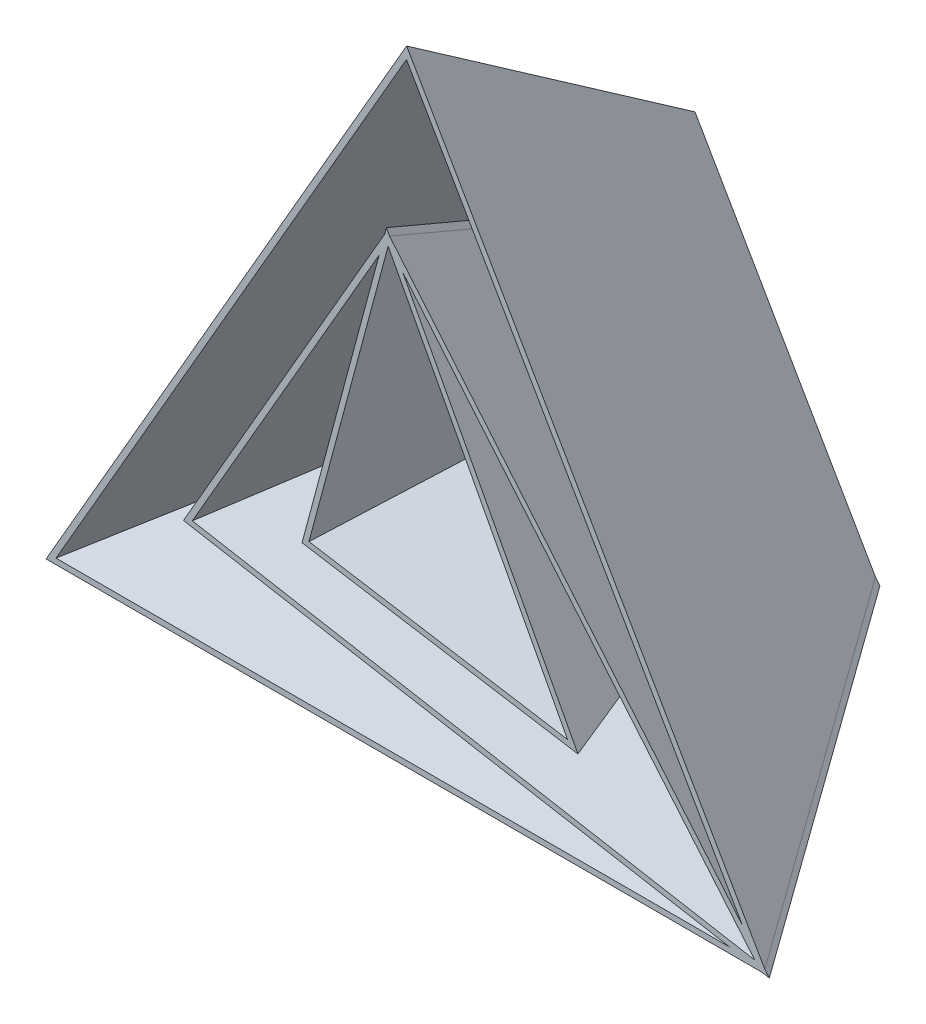
ISO-10303-21;
HEADER;
FILE_DESCRIPTION(('STEP AP214'),'2;1');
FILE_NAME('part.step','',(''),(''),'','','');
FILE_SCHEMA(('AUTOMOTIVE_DESIGN { 1 0 10303 214 1 1 1 1 }'));
ENDSEC;
DATA;
#1=APPLICATION_CONTEXT('core data for automotive mechanical design processes');
#2=APPLICATION_PROTOCOL_DEFINITION('international standard','automotive_design',2000,#1);
#3=PRODUCT_CONTEXT('',#1,'mechanical');
#4=PRODUCT('Part','Part','',(#3));
#5=PRODUCT_RELATED_PRODUCT_CATEGORY('part','',(#4));
#6=PRODUCT_DEFINITION_FORMATION('','',#4);
#7=PRODUCT_DEFINITION_CONTEXT('part definition',#1,'design');
#8=PRODUCT_DEFINITION('design','',#6,#7);
#9=PRODUCT_DEFINITION_SHAPE('','',#8);
#10=(LENGTH_UNIT() NAMED_UNIT(*) SI_UNIT(.MILLI.,.METRE.));
#11=(NAMED_UNIT(*) PLANE_ANGLE_UNIT() SI_UNIT($,.RADIAN.));
#12=(NAMED_UNIT(*) SI_UNIT($,.STERADIAN.) SOLID_ANGLE_UNIT());
#13=UNCERTAINTY_MEASURE_WITH_UNIT(LENGTH_MEASURE(1.E-05),#10,'distance_accuracy_value','');
#14=(GEOMETRIC_REPRESENTATION_CONTEXT(3) GLOBAL_UNCERTAINTY_ASSIGNED_CONTEXT((#13)) GLOBAL_UNIT_ASSIGNED_CONTEXT((#10,
#11,#12)) REPRESENTATION_CONTEXT('',''));
#15=CARTESIAN_POINT('',(0.,0.,0.));
#16=DIRECTION('',(0.,0.,1.));
#17=DIRECTION('',(1.,0.,0.));
#18=AXIS2_PLACEMENT_3D('',#15,#16,#17);
#19=CARTESIAN_POINT('',(7.50918770354472,-4.33543154203698,1.55165034379984));
#20=DIRECTION('',(-0.852483392799346,0.492181516312388,-0.176151695994541));
#21=DIRECTION('',(-0.5,-0.866025403784439,0.));
#22=AXIS2_PLACEMENT_3D('',#19,#20,#21);
#23=PLANE('',#22);
#24=DIRECTION('',(-0.0518053972687902,-0.414850654544686,-0.908413526560271));
#25=VECTOR('',#24,1.);
#26=CARTESIAN_POINT('',(40.2565005845038,43.8418837900998,-22.3173010963321));
#27=LINE('',#26,#25);
#28=CARTESIAN_POINT('',(41.529221229297,54.0336595582801,0.));
#29=VERTEX_POINT('',#28);
#30=CARTESIAN_POINT('',(39.2480840267302,35.7666196071897,-40.));
#31=VERTEX_POINT('',#30);
#32=EDGE_CURVE('E74',#29,#31,#27,.T.);
#33=ORIENTED_EDGE('',*,*,#32,.F.);
#34=DIRECTION('',(-0.5,-0.866025403784439,0.));
#35=VECTOR('',#34,1.);
#36=CARTESIAN_POINT('',(7.74965500351756,-4.47426540240759,0.));
#37=LINE('',#36,#35);
#38=CARTESIAN_POINT('',(17.8816974594018,13.0749469156289,0.));
#39=VERTEX_POINT('',#38);
#40=EDGE_CURVE('E272',#29,#39,#37,.T.);
#41=ORIENTED_EDGE('',*,*,#40,.T.);
#42=DIRECTION('',(0.249319096101502,0.0866248492887268,-0.964539332430169));
#43=VECTOR('',#42,1.);
#44=CARTESIAN_POINT('',(16.4877883121229,12.5906391682751,5.39260818528469));
#45=LINE('',#44,#43);
#46=CARTESIAN_POINT('',(28.2211035455524,16.6673291597195,-40.));
#47=VERTEX_POINT('',#46);
#48=EDGE_CURVE('E269',#39,#47,#45,.T.);
#49=ORIENTED_EDGE('',*,*,#48,.T.);
#50=DIRECTION('',(-0.5,-0.866025403784439,0.));
#51=VECTOR('',#50,1.);
#52=CARTESIAN_POINT('',(13.9486624263872,-8.05326400670986,-40.));
#53=LINE('',#52,#51);
#54=EDGE_CURVE('E70',#31,#47,#53,.T.);
#55=ORIENTED_EDGE('',*,*,#54,.F.);
#56=EDGE_LOOP('',(#33,#41,#49,#55));
#57=FACE_BOUND('',#56,.T.);
#58=ADVANCED_FACE('F55',(#57),#23,.F.);
#59=CARTESIAN_POINT('',(47.1671172501555,39.5779106883004,-20.7641485405259));
#60=DIRECTION('',(0.725880119364171,0.609085740437387,-0.319550642477364));
#61=DIRECTION('',(-0.642787609686534,0.766044443118983,0.));
#62=AXIS2_PLACEMENT_3D('',#59,#60,#61);
#63=PLANE('',#62);
#64=DIRECTION('',(0.0518053972687908,0.414850654544686,0.908413526560271));
#65=VECTOR('',#64,1.);
#66=CARTESIAN_POINT('',(43.2435767553376,43.4447390562514,-22.3062828928475));
#67=LINE('',#66,#65);
#68=CARTESIAN_POINT('',(42.2345318467171,35.3644431242602,-40.));
#69=VERTEX_POINT('',#68);
#70=CARTESIAN_POINT('',(44.5156690492841,53.6314830753507,0.));
#71=VERTEX_POINT('',#70);
#72=EDGE_CURVE('E249',#69,#71,#67,.T.);
#73=ORIENTED_EDGE('',*,*,#72,.F.);
#74=DIRECTION('',(-0.642787609686533,0.766044443118983,0.));
#75=VECTOR('',#74,1.);
#76=CARTESIAN_POINT('',(42.1978295531233,35.4081832145071,-40.));
#77=LINE('',#76,#75);
#78=CARTESIAN_POINT('',(63.0810009253125,10.5205887069397,-40.));
#79=VERTEX_POINT('',#78);
#80=EDGE_CURVE('E274',#79,#69,#77,.T.);
#81=ORIENTED_EDGE('',*,*,#80,.F.);
#82=DIRECTION('',(-0.533396460910442,0.205152484965555,-0.820609939862218));
#83=VECTOR('',#82,1.);
#84=CARTESIAN_POINT('',(63.7933731636514,10.2465993845017,-38.904042710248));
#85=LINE('',#84,#83);
#86=CARTESIAN_POINT('',(89.0810009253126,0.520588706939642,0.));
#87=VERTEX_POINT('',#86);
#88=EDGE_CURVE('E271',#87,#79,#85,.T.);
#89=ORIENTED_EDGE('',*,*,#88,.F.);
#90=DIRECTION('',(-0.642787609686534,0.766044443118983,0.));
#91=VECTOR('',#90,1.);
#92=CARTESIAN_POINT('',(52.5312170977326,44.0789248920004,0.));
#93=LINE('',#92,#91);
#94=EDGE_CURVE('E268',#87,#71,#93,.T.);
#95=ORIENTED_EDGE('',*,*,#94,.T.);
#96=EDGE_LOOP('',(#73,#81,#89,#95));
#97=FACE_BOUND('',#96,.T.);
#98=ADVANCED_FACE('F413',(#97),#63,.F.);
#99=CARTESIAN_POINT('',(6.91244932858518,-3.9909044806183,1.42834415660366));
#100=DIRECTION('',(-0.852483392799346,0.492181516312388,-0.176151695994541));
#101=DIRECTION('',(-0.5,-0.866025403784439,0.));
#102=AXIS2_PLACEMENT_3D('',#99,#100,#101);
#103=PLANE('',#102);
#104=DIRECTION('',(-0.5,-0.866025403784439,0.));
#105=VECTOR('',#104,1.);
#106=CARTESIAN_POINT('',(7.13380722931514,-4.118705524192,0.));
#107=LINE('',#106,#105);
#108=CARTESIAN_POINT('',(42.2403409857282,56.6875946195473,0.));
#109=VERTEX_POINT('',#108);
#110=CARTESIAN_POINT('',(16.760678195996,12.555524108009,0.));
#111=VERTEX_POINT('',#110);
#112=EDGE_CURVE('E290',#109,#111,#107,.T.);
#113=ORIENTED_EDGE('',*,*,#112,.F.);
#114=DIRECTION('',(-0.0518053972687902,-0.414850654544686,-0.908413526560271));
#115=VECTOR('',#114,1.);
#116=CARTESIAN_POINT('',(40.9086747850709,46.0237907669985,-23.3509181150331));
#117=LINE('',#116,#115);
#118=CARTESIAN_POINT('',(39.9592037831614,38.4205546684569,-40.));
#119=VERTEX_POINT('',#118);
#120=EDGE_CURVE('E12',#109,#119,#117,.T.);
#121=ORIENTED_EDGE('',*,*,#120,.T.);
#122=DIRECTION('',(-0.5,-0.866025403784439,0.));
#123=VECTOR('',#122,1.);
#124=CARTESIAN_POINT('',(13.3328146521848,-7.69770412849426,-40.));
#125=LINE('',#124,#123);
#126=CARTESIAN_POINT('',(27.1000842821466,16.1479063520995,-40.));
#127=VERTEX_POINT('',#126);
#128=EDGE_CURVE('E299',#119,#127,#125,.T.);
#129=ORIENTED_EDGE('',*,*,#128,.T.);
#130=DIRECTION('',(0.249319096101502,0.0866248492887268,-0.964539332430169));
#131=VECTOR('',#130,1.);
#132=CARTESIAN_POINT('',(15.4476697126136,12.099324948914,5.07962825888501));
#133=LINE('',#132,#131);
#134=EDGE_CURVE('E286',#111,#127,#133,.T.);
#135=ORIENTED_EDGE('',*,*,#134,.F.);
#136=EDGE_LOOP('',(#113,#121,#129,#135));
#137=FACE_BOUND('',#136,.T.);
#138=ADVANCED_FACE('F392',(#137),#103,.T.);
#139=CARTESIAN_POINT('',(47.6752333337104,40.0042707066066,-20.9878339902601));
#140=DIRECTION('',(0.725880119364171,0.609085740437387,-0.319550642477364));
#141=DIRECTION('',(-0.642787609686534,0.766044443118983,0.));
#142=AXIS2_PLACEMENT_3D('',#139,#140,#141);
#143=PLANE('',#142);
#144=DIRECTION('',(-0.642787609686533,0.766044443118983,0.));
#145=VECTOR('',#144,1.);
#146=CARTESIAN_POINT('',(42.7637313476831,35.8830312016047,-40.));
#147=LINE('',#146,#145);
#148=CARTESIAN_POINT('',(61.5220868883551,13.527693594849,-40.));
#149=VERTEX_POINT('',#148);
#150=CARTESIAN_POINT('',(40.5664495037521,38.5016497330516,-40.));
#151=VERTEX_POINT('',#150);
#152=EDGE_CURVE('E293',#149,#151,#147,.T.);
#153=ORIENTED_EDGE('',*,*,#152,.T.);
#154=DIRECTION('',(0.0518053972687908,0.414850654544686,0.908413526560271));
#155=VECTOR('',#154,1.);
#156=CARTESIAN_POINT('',(41.5125479252696,46.0778786613584,-23.4100566953551));
#157=LINE('',#156,#155);
#158=CARTESIAN_POINT('',(42.847586706319,56.768689684142,0.));
#159=VERTEX_POINT('',#158);
#160=EDGE_CURVE('E63',#151,#159,#157,.T.);
#161=ORIENTED_EDGE('',*,*,#160,.T.);
#162=DIRECTION('',(-0.642787609686534,0.766044443118983,0.));
#163=VECTOR('',#162,1.);
#164=CARTESIAN_POINT('',(53.0971188922924,44.5537728790981,0.));
#165=LINE('',#164,#163);
#166=CARTESIAN_POINT('',(87.5220868883551,3.52769359484903,0.));
#167=VERTEX_POINT('',#166);
#168=EDGE_CURVE('E278',#167,#159,#165,.T.);
#169=ORIENTED_EDGE('',*,*,#168,.F.);
#170=DIRECTION('',(-0.533396460910442,0.205152484965554,-0.820609939862218));
#171=VECTOR('',#170,1.);
#172=CARTESIAN_POINT('',(63.0070488404312,12.9565543825121,-37.7154431506522));
#173=LINE('',#172,#171);
#174=EDGE_CURVE('E347',#167,#149,#173,.T.);
#175=ORIENTED_EDGE('',*,*,#174,.T.);
#176=EDGE_LOOP('',(#153,#161,#169,#175));
#177=FACE_BOUND('',#176,.T.);
#178=ADVANCED_FACE('F367',(#177),#143,.T.);
#179=CARTESIAN_POINT('',(0.,0.,0.));
#180=DIRECTION('',(0.,0.,-1.));
#181=DIRECTION('',(-1.,0.,0.));
#182=AXIS2_PLACEMENT_3D('',#179,#180,#181);
#183=PLANE('',#182);
#184=ORIENTED_EDGE('',*,*,#168,.T.);
#185=DIRECTION('',(-0.469471562785884,0.88294759285893,0.));
#186=VECTOR('',#185,1.);
#187=CARTESIAN_POINT('',(56.9355149081058,30.2731502731421,0.));
#188=LINE('',#187,#186);
#189=CARTESIAN_POINT('',(42.458264858849,57.5008975862163,0.));
#190=VERTEX_POINT('',#189);
#191=EDGE_CURVE('E213',#159,#190,#188,.T.);
#192=ORIENTED_EDGE('',*,*,#191,.T.);
#193=DIRECTION('',(-0.258819045102522,-0.965925826289068,0.));
#194=VECTOR('',#193,1.);
#195=CARTESIAN_POINT('',(25.2388760170561,-6.76273644663943,0.));
#196=LINE('',#195,#194);
#197=EDGE_CURVE('E258',#190,#109,#196,.T.);
#198=ORIENTED_EDGE('',*,*,#197,.T.);
#199=ORIENTED_EDGE('',*,*,#112,.T.);
#200=DIRECTION('',(0.984807753012209,-0.173648177666924,0.));
#201=VECTOR('',#200,1.);
#202=CARTESIAN_POINT('',(2.65251736540058,15.0431735106172,0.));
#203=LINE('',#202,#201);
#204=CARTESIAN_POINT('',(85.9205555827156,0.36077174224154,0.));
#205=VERTEX_POINT('',#204);
#206=EDGE_CURVE('E303',#111,#205,#203,.T.);
#207=ORIENTED_EDGE('',*,*,#206,.T.);
#208=DIRECTION('',(-1.,0.,0.));
#209=VECTOR('',#208,1.);
#210=CARTESIAN_POINT('',(0.,0.360771742241547,0.));
#211=LINE('',#210,#209);
#212=CARTESIAN_POINT('',(0.628680999628947,0.360771742241547,0.));
#213=VERTEX_POINT('',#212);
#214=EDGE_CURVE('E333',#205,#213,#211,.T.);
#215=ORIENTED_EDGE('',*,*,#214,.T.);
#216=DIRECTION('',(0.5,0.866025403784439,0.));
#217=VECTOR('',#216,1.);
#218=CARTESIAN_POINT('',(0.315292002847334,-0.182033922717245,0.));
#219=LINE('',#218,#217);
#220=CARTESIAN_POINT('',(44.9895955360447,77.1961295895344,0.));
#221=VERTEX_POINT('',#220);
#222=EDGE_CURVE('E321',#213,#221,#219,.T.);
#223=ORIENTED_EDGE('',*,*,#222,.T.);
#224=DIRECTION('',(0.5,-0.866025403784439,0.));
#225=VECTOR('',#224,1.);
#226=CARTESIAN_POINT('',(67.1691013012198,38.7800987174845,0.));
#227=LINE('',#226,#225);
#228=EDGE_CURVE('E316',#221,#167,#227,.T.);
#229=ORIENTED_EDGE('',*,*,#228,.T.);
#230=EDGE_LOOP('',(#184,#192,#198,#199,#207,#215,#223,#229));
#231=FACE_BOUND('',#230,.T.);
#232=CARTESIAN_POINT('',(66.6913720437682,11.9250515659638,0.));
#233=VERTEX_POINT('',#232);
#234=EDGE_CURVE('E259',#233,#71,#188,.T.);
#235=ORIENTED_EDGE('',*,*,#234,.T.);
#236=ORIENTED_EDGE('',*,*,#94,.F.);
#237=DIRECTION('',(0.984807753012209,-0.173648177666924,0.));
#238=VECTOR('',#237,1.);
#239=CARTESIAN_POINT('',(2.77514676386724,15.7386393886918,0.));
#240=LINE('',#239,#238);
#241=EDGE_CURVE('E282',#39,#87,#240,.T.);
#242=ORIENTED_EDGE('',*,*,#241,.F.);
#243=ORIENTED_EDGE('',*,*,#40,.F.);
#244=CARTESIAN_POINT('',(31.7705211765705,17.6136951456797,0.));
#245=VERTEX_POINT('',#244);
#246=EDGE_CURVE('E262',#29,#245,#196,.T.);
#247=ORIENTED_EDGE('',*,*,#246,.T.);
#248=DIRECTION('',(0.986989989981482,-0.160781714371859,0.));
#249=VECTOR('',#248,1.);
#250=CARTESIAN_POINT('',(3.61640838037537,22.2000299291519,0.));
#251=LINE('',#250,#249);
#252=EDGE_CURVE('E240',#245,#233,#251,.T.);
#253=ORIENTED_EDGE('',*,*,#252,.T.);
#254=EDGE_LOOP('',(#235,#236,#242,#243,#247,#253));
#255=FACE_BOUND('',#254,.T.);
#256=DIRECTION('',(-0.469471562785884,0.88294759285893,0.));
#257=VECTOR('',#256,1.);
#258=CARTESIAN_POINT('',(56.2961576686903,29.9331979987438,0.));
#259=LINE('',#258,#257);
#260=CARTESIAN_POINT('',(65.3803330450879,12.848348952505,0.));
#261=VERTEX_POINT('',#260);
#262=CARTESIAN_POINT('',(42.6662839514185,55.5672622181456,0.));
#263=VERTEX_POINT('',#262);
#264=EDGE_CURVE('E232',#261,#263,#259,.T.);
#265=ORIENTED_EDGE('',*,*,#264,.F.);
#266=DIRECTION('',(0.986989989981482,-0.160781714371859,0.));
#267=VECTOR('',#266,1.);
#268=CARTESIAN_POINT('',(3.72903503561982,22.8914106733221,0.));
#269=LINE('',#268,#267);
#270=CARTESIAN_POINT('',(32.6485040254953,18.1803985555566,0.));
#271=VERTEX_POINT('',#270);
#272=EDGE_CURVE('E222',#271,#261,#269,.T.);
#273=ORIENTED_EDGE('',*,*,#272,.F.);
#274=DIRECTION('',(-0.258819045102522,-0.965925826289068,0.));
#275=VECTOR('',#274,1.);
#276=CARTESIAN_POINT('',(25.9163693146772,-6.94427022861451,0.));
#277=LINE('',#276,#275);
#278=EDGE_CURVE('E221',#263,#271,#277,.T.);
#279=ORIENTED_EDGE('',*,*,#278,.F.);
#280=EDGE_LOOP('',(#265,#273,#279));
#281=FACE_BOUND('',#280,.T.);
#282=DIRECTION('',(-1.,0.,0.));
#283=VECTOR('',#282,1.);
#284=CARTESIAN_POINT('',(0.,-0.360771742241544,0.));
#285=LINE('',#284,#283);
#286=CARTESIAN_POINT('',(90.0126320283283,-0.360771742241548,0.));
#287=VERTEX_POINT('',#286);
#288=CARTESIAN_POINT('',(-0.628680999628982,-0.360771742241543,0.));
#289=VERTEX_POINT('',#288);
#290=EDGE_CURVE('E354',#287,#289,#285,.T.);
#291=ORIENTED_EDGE('',*,*,#290,.F.);
#292=CARTESIAN_POINT('',(90.9189990746875,-0.520588706939697,0.));
#293=VERTEX_POINT('',#292);
#294=EDGE_CURVE('E306',#287,#293,#203,.T.);
#295=ORIENTED_EDGE('',*,*,#294,.T.);
#296=CARTESIAN_POINT('',(90.3508181498955,0.156542951424623,0.));
#297=VERTEX_POINT('',#296);
#298=EDGE_CURVE('E307',#293,#297,#165,.T.);
#299=ORIENTED_EDGE('',*,*,#298,.T.);
#300=DIRECTION('',(0.5,-0.866025403784439,0.));
#301=VECTOR('',#300,1.);
#302=CARTESIAN_POINT('',(67.8308986987802,39.162187623115,0.));
#303=LINE('',#302,#301);
#304=CARTESIAN_POINT('',(45.0104044639552,78.6884430916645,0.));
#305=VERTEX_POINT('',#304);
#306=EDGE_CURVE('E327',#305,#297,#303,.T.);
#307=ORIENTED_EDGE('',*,*,#306,.F.);
#308=DIRECTION('',(0.5,0.866025403784439,0.));
#309=VECTOR('',#308,1.);
#310=CARTESIAN_POINT('',(-0.315292002847363,0.182033922717261,0.));
#311=LINE('',#310,#309);
#312=EDGE_CURVE('E341',#289,#305,#311,.T.);
#313=ORIENTED_EDGE('',*,*,#312,.F.);
#314=EDGE_LOOP('',(#291,#295,#299,#307,#313));
#315=FACE_BOUND('',#314,.T.);
#316=ADVANCED_FACE('F372',(#231,#255,#281,#315),#183,.F.);
#317=CARTESIAN_POINT('',(0.,0.,-40.));
#318=DIRECTION('',(0.,0.,-1.));
#319=DIRECTION('',(-1.,0.,0.));
#320=AXIS2_PLACEMENT_3D('',#317,#318,#319);
#321=PLANE('',#320);
#322=DIRECTION('',(0.469471562785884,-0.882947592858931,0.));
#323=VECTOR('',#322,1.);
#324=CARTESIAN_POINT('',(47.5851172096542,25.3014556270897,-40.));
#325=LINE('',#324,#323);
#326=CARTESIAN_POINT('',(40.1771276562821,39.2338576351258,-40.));
#327=VERTEX_POINT('',#326);
#328=EDGE_CURVE('E250',#327,#151,#325,.T.);
#329=ORIENTED_EDGE('',*,*,#328,.T.);
#330=ORIENTED_EDGE('',*,*,#152,.F.);
#331=DIRECTION('',(0.5,-0.866025403784439,0.));
#332=VECTOR('',#331,1.);
#333=CARTESIAN_POINT('',(51.999228320142,30.0217684682868,-40.));
#334=LINE('',#333,#332);
#335=CARTESIAN_POINT('',(41.4895955360447,48.2249864192347,-40.));
#336=VERTEX_POINT('',#335);
#337=EDGE_CURVE('E324',#336,#149,#334,.T.);
#338=ORIENTED_EDGE('',*,*,#337,.F.);
#339=DIRECTION('',(0.5,0.866025403784439,0.));
#340=VECTOR('',#339,1.);
#341=CARTESIAN_POINT('',(10.2351649839251,-5.90927525866942,-40.));
#342=LINE('',#341,#340);
#343=CARTESIAN_POINT('',(19.628680999629,10.3607717422415,-40.));
#344=VERTEX_POINT('',#343);
#345=EDGE_CURVE('E325',#344,#336,#342,.T.);
#346=ORIENTED_EDGE('',*,*,#345,.F.);
#347=DIRECTION('',(-1.,0.,0.));
#348=VECTOR('',#347,1.);
#349=CARTESIAN_POINT('',(0.,10.3607717422415,-40.));
#350=LINE('',#349,#348);
#351=CARTESIAN_POINT('',(59.9205555827157,10.3607717422416,-40.));
#352=VERTEX_POINT('',#351);
#353=EDGE_CURVE('E328',#352,#344,#350,.T.);
#354=ORIENTED_EDGE('',*,*,#353,.F.);
#355=DIRECTION('',(0.984807753012209,-0.173648177666923,0.));
#356=VECTOR('',#355,1.);
#357=CARTESIAN_POINT('',(3.57862215224568,20.2953747513133,-40.));
#358=LINE('',#357,#356);
#359=EDGE_CURVE('E294',#127,#352,#358,.T.);
#360=ORIENTED_EDGE('',*,*,#359,.F.);
#361=ORIENTED_EDGE('',*,*,#128,.F.);
#362=DIRECTION('',(0.258819045102521,0.965925826289068,0.));
#363=VECTOR('',#362,1.);
#364=CARTESIAN_POINT('',(27.677306020075,-7.41611179674802,-40.0000000000001));
#365=LINE('',#364,#363);
#366=EDGE_CURVE('E246',#119,#327,#365,.T.);
#367=ORIENTED_EDGE('',*,*,#366,.T.);
#368=EDGE_LOOP('',(#329,#330,#338,#346,#354,#360,#361,#367));
#369=FACE_BOUND('',#368,.T.);
#370=CARTESIAN_POINT('',(34.6657648760541,18.6651717203706,-40.0000000000001));
#371=VERTEX_POINT('',#370);
#372=EDGE_CURVE('E251',#371,#31,#365,.T.);
#373=ORIENTED_EDGE('',*,*,#372,.T.);
#374=ORIENTED_EDGE('',*,*,#54,.T.);
#375=DIRECTION('',(0.984807753012209,-0.173648177666923,0.));
#376=VECTOR('',#375,1.);
#377=CARTESIAN_POINT('',(3.70125155071233,20.9908406293879,-40.));
#378=LINE('',#377,#376);
#379=EDGE_CURVE('E275',#47,#79,#378,.T.);
#380=ORIENTED_EDGE('',*,*,#379,.T.);
#381=ORIENTED_EDGE('',*,*,#80,.T.);
#382=CARTESIAN_POINT('',(52.6734457715542,15.7317014363466,-40.));
#383=VERTEX_POINT('',#382);
#384=EDGE_CURVE('E254',#69,#383,#325,.T.);
#385=ORIENTED_EDGE('',*,*,#384,.T.);
#386=DIRECTION('',(-0.986989989981482,0.160781714371859,0.));
#387=VECTOR('',#386,1.);
#388=CARTESIAN_POINT('',(3.85811138679822,23.6837710922545,-40.0000000000001));
#389=LINE('',#388,#387);
#390=EDGE_CURVE('E247',#383,#371,#389,.T.);
#391=ORIENTED_EDGE('',*,*,#390,.T.);
#392=EDGE_LOOP('',(#373,#374,#380,#381,#385,#391));
#393=FACE_BOUND('',#392,.T.);
#394=DIRECTION('',(0.258819045102521,0.965925826289068,0.));
#395=VECTOR('',#394,1.);
#396=CARTESIAN_POINT('',(28.3547993176961,-7.59764557872311,-40.0000000000001));
#397=LINE('',#396,#395);
#398=CARTESIAN_POINT('',(35.5437477249789,19.2318751302475,-40.0000000000001));
#399=VERTEX_POINT('',#398);
#400=CARTESIAN_POINT('',(40.3851467488517,37.3002222670551,-40.));
#401=VERTEX_POINT('',#400);
#402=EDGE_CURVE('E219',#399,#401,#397,.T.);
#403=ORIENTED_EDGE('',*,*,#402,.F.);
#404=DIRECTION('',(-0.986989989981482,0.160781714371859,0.));
#405=VECTOR('',#404,1.);
#406=CARTESIAN_POINT('',(3.97073804204267,24.3751518364247,-40.0000000000001));
#407=LINE('',#406,#405);
#408=CARTESIAN_POINT('',(51.3624067728739,16.6549988228878,-40.));
#409=VERTEX_POINT('',#408);
#410=EDGE_CURVE('E203',#409,#399,#407,.T.);
#411=ORIENTED_EDGE('',*,*,#410,.F.);
#412=DIRECTION('',(0.469471562785884,-0.882947592858931,0.));
#413=VECTOR('',#412,1.);
#414=CARTESIAN_POINT('',(46.9457599702386,24.9615033526914,-40.));
#415=LINE('',#414,#413);
#416=EDGE_CURVE('E214',#401,#409,#415,.T.);
#417=ORIENTED_EDGE('',*,*,#416,.F.);
#418=EDGE_LOOP('',(#403,#411,#417));
#419=FACE_BOUND('',#418,.T.);
#420=CARTESIAN_POINT('',(64.0126320283284,9.63922825775846,-40.0000000000001));
#421=VERTEX_POINT('',#420);
#422=CARTESIAN_POINT('',(64.9189990746874,9.47941129306034,-40.0000000000001));
#423=VERTEX_POINT('',#422);
#424=EDGE_CURVE('E298',#421,#423,#358,.T.);
#425=ORIENTED_EDGE('',*,*,#424,.F.);
#426=DIRECTION('',(-1.,0.,0.));
#427=VECTOR('',#426,1.);
#428=CARTESIAN_POINT('',(0.,9.63922825775845,-40.));
#429=LINE('',#428,#427);
#430=CARTESIAN_POINT('',(18.371319000371,9.63922825775846,-40.));
#431=VERTEX_POINT('',#430);
#432=EDGE_CURVE('E348',#421,#431,#429,.T.);
#433=ORIENTED_EDGE('',*,*,#432,.T.);
#434=DIRECTION('',(0.5,0.866025403784439,0.));
#435=VECTOR('',#434,1.);
#436=CARTESIAN_POINT('',(9.60458097823045,-5.54520741323492,-40.));
#437=LINE('',#436,#435);
#438=CARTESIAN_POINT('',(41.5104044639552,49.7172999213647,-40.));
#439=VERTEX_POINT('',#438);
#440=EDGE_CURVE('E345',#431,#439,#437,.T.);
#441=ORIENTED_EDGE('',*,*,#440,.T.);
#442=DIRECTION('',(0.5,-0.866025403784439,0.));
#443=VECTOR('',#442,1.);
#444=CARTESIAN_POINT('',(52.6610257177024,30.4038573739173,-40.));
#445=LINE('',#444,#443);
#446=CARTESIAN_POINT('',(64.3508181498955,10.1565429514246,-40.));
#447=VERTEX_POINT('',#446);
#448=EDGE_CURVE('E344',#439,#447,#445,.T.);
#449=ORIENTED_EDGE('',*,*,#448,.T.);
#450=EDGE_CURVE('E301',#423,#447,#147,.T.);
#451=ORIENTED_EDGE('',*,*,#450,.F.);
#452=EDGE_LOOP('',(#425,#433,#441,#449,#451));
#453=FACE_BOUND('',#452,.T.);
#454=ADVANCED_FACE('F224',(#369,#393,#419,#453),#321,.T.);
#455=CARTESIAN_POINT('',(-0.291396544061684,0.16823787315494,-0.0963538901405651));
#456=DIRECTION('',(0.832561554461918,-0.480679637585522,0.275296828973031));
#457=DIRECTION('',(0.5,0.866025403784439,0.));
#458=AXIS2_PLACEMENT_3D('',#455,#456,#457);
#459=PLANE('',#458);
#460=DIRECTION('',(-0.0706879298359585,-0.585117181625618,-0.807862055268101));
#461=VECTOR('',#460,1.);
#462=CARTESIAN_POINT('',(41.5308863795956,49.8868383529128,-39.7659209641105));
#463=LINE('',#462,#461);
#464=EDGE_CURVE('E337',#305,#439,#463,.T.);
#465=ORIENTED_EDGE('',*,*,#464,.T.);
#466=ORIENTED_EDGE('',*,*,#440,.F.);
#467=DIRECTION('',(0.41851844695489,0.220272866818363,-0.881091467273453));
#468=VECTOR('',#467,1.);
#469=CARTESIAN_POINT('',(-0.48530376921076,-0.285310042021426,-0.301846800880468));
#470=LINE('',#469,#468);
#471=EDGE_CURVE('E340',#289,#431,#470,.T.);
#472=ORIENTED_EDGE('',*,*,#471,.F.);
#473=ORIENTED_EDGE('',*,*,#312,.T.);
#474=EDGE_LOOP('',(#465,#466,#472,#473));
#475=FACE_BOUND('',#474,.T.);
#476=ADVANCED_FACE('F449',(#475),#459,.F.);
#477=CARTESIAN_POINT('',(0.,-0.339549875050864,-0.0848874687627161));
#478=DIRECTION('',(0.,0.970142500145332,0.242535625036333));
#479=DIRECTION('',(0.,-0.242535625036333,0.970142500145332));
#480=AXIS2_PLACEMENT_3D('',#477,#478,#479);
#481=PLANE('',#480);
#482=ORIENTED_EDGE('',*,*,#432,.F.);
#483=DIRECTION('',(0.533396460910441,-0.205152484965555,0.820609939862219));
#484=VECTOR('',#483,1.);
#485=CARTESIAN_POINT('',(64.3634990720436,9.50427939479107,-39.4602045481305));
#486=LINE('',#485,#484);
#487=EDGE_CURVE('E313',#421,#287,#486,.T.);
#488=ORIENTED_EDGE('',*,*,#487,.T.);
#489=ORIENTED_EDGE('',*,*,#290,.T.);
#490=ORIENTED_EDGE('',*,*,#471,.T.);
#491=EDGE_LOOP('',(#482,#488,#489,#490));
#492=FACE_BOUND('',#491,.T.);
#493=ADVANCED_FACE('F409',(#492),#481,.F.);
#494=CARTESIAN_POINT('',(56.916056852012,32.8605007447212,-28.7803117676275));
#495=DIRECTION('',(-0.793294144001325,-0.458008587585719,0.401139046704431));
#496=DIRECTION('',(0.5,-0.866025403784439,0.));
#497=AXIS2_PLACEMENT_3D('',#494,#495,#496);
#498=PLANE('',#497);
#499=ORIENTED_EDGE('',*,*,#306,.T.);
#500=DIRECTION('',(-0.533396460910442,0.205152484965554,-0.820609939862218));
#501=VECTOR('',#500,1.);
#502=CARTESIAN_POINT('',(64.6620757669162,10.0368284833398,-39.5211421276606));
#503=LINE('',#502,#501);
#504=EDGE_CURVE('E297',#297,#447,#503,.T.);
#505=ORIENTED_EDGE('',*,*,#504,.T.);
#506=ORIENTED_EDGE('',*,*,#448,.F.);
#507=ORIENTED_EDGE('',*,*,#464,.F.);
#508=EDGE_LOOP('',(#499,#505,#506,#507));
#509=FACE_BOUND('',#508,.T.);
#510=ADVANCED_FACE('F57',(#509),#498,.F.);
#511=CARTESIAN_POINT('',(0.291396544061658,-0.168237873154925,0.0963538901405565));
#512=DIRECTION('',(0.832561554461918,-0.480679637585522,0.275296828973031));
#513=DIRECTION('',(0.5,0.866025403784439,0.));
#514=AXIS2_PLACEMENT_3D('',#511,#512,#513);
#515=PLANE('',#514);
#516=DIRECTION('',(-0.0706879298359585,-0.585117181625618,-0.807862055268101));
#517=VECTOR('',#516,1.);
#518=CARTESIAN_POINT('',(41.5719045937083,48.9062971317441,-39.0593250552739));
#519=LINE('',#518,#517);
#520=EDGE_CURVE('E317',#221,#336,#519,.T.);
#521=ORIENTED_EDGE('',*,*,#520,.F.);
#522=ORIENTED_EDGE('',*,*,#222,.F.);
#523=DIRECTION('',(0.41851844695489,0.220272866818363,-0.881091467273453));
#524=VECTOR('',#523,1.);
#525=CARTESIAN_POINT('',(0.48530376921073,0.285310042021433,0.301846800880455));
#526=LINE('',#525,#524);
#527=EDGE_CURVE('E320',#213,#344,#526,.T.);
#528=ORIENTED_EDGE('',*,*,#527,.T.);
#529=ORIENTED_EDGE('',*,*,#345,.T.);
#530=EDGE_LOOP('',(#521,#522,#528,#529));
#531=FACE_BOUND('',#530,.T.);
#532=ADVANCED_FACE('F401',(#531),#515,.T.);
#533=CARTESIAN_POINT('',(0.,0.339549875050868,0.084887468762717));
#534=DIRECTION('',(0.,0.970142500145332,0.242535625036333));
#535=DIRECTION('',(0.,-0.242535625036333,0.970142500145332));
#536=AXIS2_PLACEMENT_3D('',#533,#534,#535);
#537=PLANE('',#536);
#538=DIRECTION('',(0.533396460910441,-0.205152484965555,0.820609939862219));
#539=VECTOR('',#538,1.);
#540=CARTESIAN_POINT('',(61.5146233769359,9.74766874446456,-37.5475880088921));
#541=LINE('',#540,#539);
#542=EDGE_CURVE('E360',#352,#205,#541,.T.);
#543=ORIENTED_EDGE('',*,*,#542,.F.);
#544=ORIENTED_EDGE('',*,*,#353,.T.);
#545=ORIENTED_EDGE('',*,*,#527,.F.);
#546=ORIENTED_EDGE('',*,*,#214,.F.);
#547=EDGE_LOOP('',(#543,#544,#545,#546));
#548=FACE_BOUND('',#547,.T.);
#549=ADVANCED_FACE('F398',(#548),#537,.T.);
#550=CARTESIAN_POINT('',(56.3607509512111,32.5398947334112,-28.4995144349344));
#551=DIRECTION('',(-0.793294144001325,-0.458008587585719,0.401139046704431));
#552=DIRECTION('',(0.5,-0.866025403784439,0.));
#553=AXIS2_PLACEMENT_3D('',#550,#551,#552);
#554=PLANE('',#553);
#555=ORIENTED_EDGE('',*,*,#174,.F.);
#556=ORIENTED_EDGE('',*,*,#228,.F.);
#557=ORIENTED_EDGE('',*,*,#520,.T.);
#558=ORIENTED_EDGE('',*,*,#337,.T.);
#559=EDGE_LOOP('',(#555,#556,#557,#558));
#560=FACE_BOUND('',#559,.T.);
#561=ADVANCED_FACE('F378',(#560),#554,.T.);
#562=CARTESIAN_POINT('',(2.72667452102678,15.4637396391146,2.09359647111125));
#563=DIRECTION('',(-0.172124979726378,-0.976169268224314,-0.132161080233933));
#564=DIRECTION('',(0.984807753012209,-0.173648177666924,0.));
#565=AXIS2_PLACEMENT_3D('',#562,#563,#564);
#566=PLANE('',#565);
#567=ORIENTED_EDGE('',*,*,#48,.F.);
#568=ORIENTED_EDGE('',*,*,#241,.T.);
#569=ORIENTED_EDGE('',*,*,#88,.T.);
#570=ORIENTED_EDGE('',*,*,#379,.F.);
#571=EDGE_LOOP('',(#567,#568,#569,#570));
#572=FACE_BOUND('',#571,.T.);
#573=ADVANCED_FACE('F425',(#572),#566,.F.);
#574=CARTESIAN_POINT('',(2.60618703521831,14.7804211513576,2.0010837149475));
#575=DIRECTION('',(-0.172124979726378,-0.976169268224314,-0.132161080233933));
#576=DIRECTION('',(0.984807753012209,-0.173648177666924,0.));
#577=AXIS2_PLACEMENT_3D('',#574,#575,#576);
#578=PLANE('',#577);
#579=ORIENTED_EDGE('',*,*,#359,.T.);
#580=ORIENTED_EDGE('',*,*,#542,.T.);
#581=ORIENTED_EDGE('',*,*,#206,.F.);
#582=ORIENTED_EDGE('',*,*,#134,.T.);
#583=EDGE_LOOP('',(#579,#580,#581,#582));
#584=FACE_BOUND('',#583,.T.);
#585=ADVANCED_FACE('F395',(#584),#578,.T.);
#586=ORIENTED_EDGE('',*,*,#487,.F.);
#587=ORIENTED_EDGE('',*,*,#424,.T.);
#588=DIRECTION('',(-0.533396460910442,0.205152484965555,-0.820609939862218));
#589=VECTOR('',#588,1.);
#590=CARTESIAN_POINT('',(64.9945056242274,9.45037031246803,-39.8838360776308));
#591=LINE('',#590,#589);
#592=EDGE_CURVE('E289',#293,#423,#591,.T.);
#593=ORIENTED_EDGE('',*,*,#592,.F.);
#594=ORIENTED_EDGE('',*,*,#294,.F.);
#595=EDGE_LOOP('',(#586,#587,#593,#594));
#596=FACE_BOUND('',#595,.T.);
#597=ADVANCED_FACE('F424',(#596),#578,.T.);
#598=ORIENTED_EDGE('',*,*,#504,.F.);
#599=ORIENTED_EDGE('',*,*,#298,.F.);
#600=ORIENTED_EDGE('',*,*,#592,.T.);
#601=ORIENTED_EDGE('',*,*,#450,.T.);
#602=EDGE_LOOP('',(#598,#599,#600,#601));
#603=FACE_BOUND('',#602,.T.);
#604=ADVANCED_FACE('F427',(#603),#143,.T.);
#605=CARTESIAN_POINT('',(53.2061717941452,28.2902233655474,-15.953730458238));
#606=DIRECTION('',(-0.853540841601486,-0.453835715787779,0.255931972980362));
#607=DIRECTION('',(0.469471562785884,-0.88294759285893,0.));
#608=AXIS2_PLACEMENT_3D('',#605,#606,#607);
#609=PLANE('',#608);
#610=ORIENTED_EDGE('',*,*,#160,.F.);
#611=ORIENTED_EDGE('',*,*,#328,.F.);
#612=DIRECTION('',(-0.0518053972687904,-0.414850654544687,-0.908413526560271));
#613=VECTOR('',#612,1.);
#614=CARTESIAN_POINT('',(41.108534691158,46.692439914902,-23.6676718291605));
#615=LINE('',#614,#613);
#616=EDGE_CURVE('E243',#190,#327,#615,.T.);
#617=ORIENTED_EDGE('',*,*,#616,.F.);
#618=ORIENTED_EDGE('',*,*,#191,.F.);
#619=EDGE_LOOP('',(#610,#611,#617,#618));
#620=FACE_BOUND('',#619,.T.);
#621=ADVANCED_FACE('F385',(#620),#609,.F.);
#622=CARTESIAN_POINT('',(25.1387477527099,-6.73590715906835,1.64250381142217));
#623=DIRECTION('',(0.964007900325788,-0.258305138389518,0.0629858999382934));
#624=DIRECTION('',(0.258819045102522,0.965925826289068,0.));
#625=AXIS2_PLACEMENT_3D('',#622,#623,#624);
#626=PLANE('',#625);
#627=ORIENTED_EDGE('',*,*,#120,.F.);
#628=ORIENTED_EDGE('',*,*,#197,.F.);
#629=ORIENTED_EDGE('',*,*,#616,.T.);
#630=ORIENTED_EDGE('',*,*,#366,.F.);
#631=EDGE_LOOP('',(#627,#628,#629,#630));
#632=FACE_BOUND('',#631,.T.);
#633=ADVANCED_FACE('F387',(#632),#626,.F.);
#634=ORIENTED_EDGE('',*,*,#246,.F.);
#635=ORIENTED_EDGE('',*,*,#32,.T.);
#636=ORIENTED_EDGE('',*,*,#372,.F.);
#637=DIRECTION('',(0.0721674314573556,0.0262093182852129,-0.99704810990838));
#638=VECTOR('',#637,1.);
#639=CARTESIAN_POINT('',(31.5717403273748,17.541503154911,2.74630904792046));
#640=LINE('',#639,#638);
#641=EDGE_CURVE('E236',#245,#371,#640,.T.);
#642=ORIENTED_EDGE('',*,*,#641,.F.);
#643=EDGE_LOOP('',(#634,#635,#636,#642));
#644=FACE_BOUND('',#643,.T.);
#645=ADVANCED_FACE('F554',(#644),#626,.F.);
#646=ORIENTED_EDGE('',*,*,#384,.F.);
#647=ORIENTED_EDGE('',*,*,#72,.T.);
#648=ORIENTED_EDGE('',*,*,#234,.F.);
#649=DIRECTION('',(-0.329401372812808,0.0894508694632867,-0.939943231020523));
#650=VECTOR('',#649,1.);
#651=CARTESIAN_POINT('',(59.8063815830987,13.7947109960211,-19.6462453203701));
#652=LINE('',#651,#650);
#653=EDGE_CURVE('E239',#233,#383,#652,.T.);
#654=ORIENTED_EDGE('',*,*,#653,.T.);
#655=EDGE_LOOP('',(#646,#647,#648,#654));
#656=FACE_BOUND('',#655,.T.);
#657=ADVANCED_FACE('F547',(#656),#609,.F.);
#658=CARTESIAN_POINT('',(3.61130761560682,22.1687178873101,0.844137579260519));
#659=DIRECTION('',(0.160668287042456,0.98629369414244,0.0375559640230658));
#660=DIRECTION('',(-0.986989989981482,0.160781714371859,0.));
#661=AXIS2_PLACEMENT_3D('',#658,#659,#660);
#662=PLANE('',#661);
#663=ORIENTED_EDGE('',*,*,#641,.T.);
#664=ORIENTED_EDGE('',*,*,#390,.F.);
#665=ORIENTED_EDGE('',*,*,#653,.F.);
#666=ORIENTED_EDGE('',*,*,#252,.F.);
#667=EDGE_LOOP('',(#663,#664,#665,#666));
#668=FACE_BOUND('',#667,.T.);
#669=ADVANCED_FACE('F569',(#668),#662,.F.);
#670=CARTESIAN_POINT('',(3.72377541653654,22.8591234732099,0.870426754076665));
#671=DIRECTION('',(0.160668287042456,0.98629369414244,0.0375559640230658));
#672=DIRECTION('',(-0.986989989981482,0.160781714371859,0.));
#673=AXIS2_PLACEMENT_3D('',#670,#671,#672);
#674=PLANE('',#673);
#675=DIRECTION('',(0.0721674314573556,0.0262093182852129,-0.99704810990838));
#676=VECTOR('',#675,1.);
#677=CARTESIAN_POINT('',(32.4440786239501,18.1061566114208,2.82429284390337));
#678=LINE('',#677,#676);
#679=EDGE_CURVE('E206',#271,#399,#678,.T.);
#680=ORIENTED_EDGE('',*,*,#679,.F.);
#681=ORIENTED_EDGE('',*,*,#272,.T.);
#682=DIRECTION('',(-0.329401372812808,0.0894508694632867,-0.939943231020523));
#683=VECTOR('',#682,1.);
#684=CARTESIAN_POINT('',(58.664802395971,14.6719905795611,-19.1626935930695));
#685=LINE('',#684,#683);
#686=EDGE_CURVE('E209',#261,#409,#685,.T.);
#687=ORIENTED_EDGE('',*,*,#686,.T.);
#688=ORIENTED_EDGE('',*,*,#410,.T.);
#689=EDGE_LOOP('',(#680,#681,#687,#688));
#690=FACE_BOUND('',#689,.T.);
#691=ADVANCED_FACE('F205',(#690),#674,.T.);
#692=CARTESIAN_POINT('',(52.6086932050241,27.972538364496,-15.7745780771517));
#693=DIRECTION('',(-0.853540841601486,-0.453835715787779,0.255931972980362));
#694=DIRECTION('',(0.469471562785884,-0.88294759285893,0.));
#695=AXIS2_PLACEMENT_3D('',#692,#693,#694);
#696=PLANE('',#695);
#697=ORIENTED_EDGE('',*,*,#686,.F.);
#698=ORIENTED_EDGE('',*,*,#264,.T.);
#699=DIRECTION('',(-0.0518053972687904,-0.414850654544687,-0.908413526560271));
#700=VECTOR('',#699,1.);
#701=CARTESIAN_POINT('',(41.357552232504,45.087114611167,-22.9487593721563));
#702=LINE('',#701,#700);
#703=EDGE_CURVE('E226',#263,#401,#702,.T.);
#704=ORIENTED_EDGE('',*,*,#703,.T.);
#705=ORIENTED_EDGE('',*,*,#416,.T.);
#706=EDGE_LOOP('',(#697,#698,#704,#705));
#707=FACE_BOUND('',#706,.T.);
#708=ADVANCED_FACE('F585',(#707),#696,.T.);
#709=CARTESIAN_POINT('',(25.813553282938,-6.91672075594102,1.68659394137897));
#710=DIRECTION('',(0.964007900325788,-0.258305138389518,0.0629858999382934));
#711=DIRECTION('',(0.258819045102522,0.965925826289068,0.));
#712=AXIS2_PLACEMENT_3D('',#709,#710,#711);
#713=PLANE('',#712);
#714=ORIENTED_EDGE('',*,*,#703,.F.);
#715=ORIENTED_EDGE('',*,*,#278,.T.);
#716=ORIENTED_EDGE('',*,*,#679,.T.);
#717=ORIENTED_EDGE('',*,*,#402,.T.);
#718=EDGE_LOOP('',(#714,#715,#716,#717));
#719=FACE_BOUND('',#718,.T.);
#720=ADVANCED_FACE('F218',(#719),#713,.T.);
#721=CLOSED_SHELL('',(#58,#98,#138,#178,#316,#454,#476,#493,#510,#532,#549,#561,#573,#585,#597,
#604,#621,#633,#645,#657,#669,#691,#708,#720));
#722=MANIFOLD_SOLID_BREP('B2',#721);
#723=ADVANCED_BREP_SHAPE_REPRESENTATION('',(#18,#722),#14);
#724=SHAPE_DEFINITION_REPRESENTATION(#9,#723);
ENDSEC;
END-ISO-10303-21;
